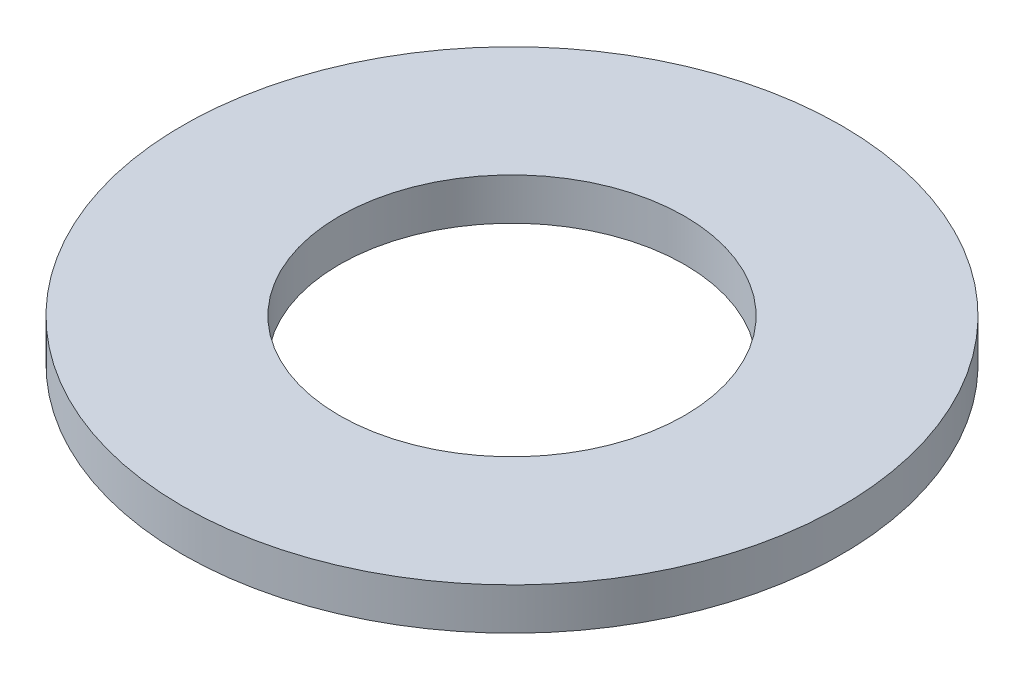
ISO-10303-21;
HEADER;
FILE_DESCRIPTION(('STEP AP214'),'2;1');
FILE_NAME('part.step','',(''),(''),'','','');
FILE_SCHEMA(('AUTOMOTIVE_DESIGN { 1 0 10303 214 1 1 1 1 }'));
ENDSEC;
DATA;
#1=APPLICATION_CONTEXT('core data for automotive mechanical design processes');
#2=APPLICATION_PROTOCOL_DEFINITION('international standard','automotive_design',2000,#1);
#3=PRODUCT_CONTEXT('',#1,'mechanical');
#4=PRODUCT('Part','Part','',(#3));
#5=PRODUCT_RELATED_PRODUCT_CATEGORY('part','',(#4));
#6=PRODUCT_DEFINITION_FORMATION('','',#4);
#7=PRODUCT_DEFINITION_CONTEXT('part definition',#1,'design');
#8=PRODUCT_DEFINITION('design','',#6,#7);
#9=PRODUCT_DEFINITION_SHAPE('','',#8);
#10=(LENGTH_UNIT() NAMED_UNIT(*) SI_UNIT(.MILLI.,.METRE.));
#11=(NAMED_UNIT(*) PLANE_ANGLE_UNIT() SI_UNIT($,.RADIAN.));
#12=(NAMED_UNIT(*) SI_UNIT($,.STERADIAN.) SOLID_ANGLE_UNIT());
#13=UNCERTAINTY_MEASURE_WITH_UNIT(LENGTH_MEASURE(1.E-05),#10,'distance_accuracy_value','');
#14=(GEOMETRIC_REPRESENTATION_CONTEXT(3) GLOBAL_UNCERTAINTY_ASSIGNED_CONTEXT((#13)) GLOBAL_UNIT_ASSIGNED_CONTEXT((#10,
#11,#12)) REPRESENTATION_CONTEXT('',''));
#15=CARTESIAN_POINT('',(0.,0.,0.));
#16=DIRECTION('',(0.,0.,1.));
#17=DIRECTION('',(1.,0.,0.));
#18=AXIS2_PLACEMENT_3D('',#15,#16,#17);
#19=CARTESIAN_POINT('',(0.,1.,0.));
#20=DIRECTION('',(0.,1.,0.));
#21=DIRECTION('',(0.,0.,1.));
#22=AXIS2_PLACEMENT_3D('',#19,#20,#21);
#23=PLANE('',#22);
#24=CARTESIAN_POINT('',(0.,1.,0.));
#25=DIRECTION('',(0.,1.,0.));
#26=DIRECTION('',(0.,0.,1.));
#27=AXIS2_PLACEMENT_3D('',#24,#25,#26);
#28=CIRCLE('',#27,7.875);
#29=CARTESIAN_POINT('',(0.,1.,7.875));
#30=VERTEX_POINT('',#29);
#31=EDGE_CURVE('E10',#30,#30,#28,.T.);
#32=ORIENTED_EDGE('',*,*,#31,.T.);
#33=EDGE_LOOP('',(#32));
#34=FACE_BOUND('',#33,.T.);
#35=CARTESIAN_POINT('',(0.,1.,0.));
#36=DIRECTION('',(0.,1.,0.));
#37=DIRECTION('',(0.,0.,1.));
#38=AXIS2_PLACEMENT_3D('',#35,#36,#37);
#39=CIRCLE('',#38,4.125);
#40=CARTESIAN_POINT('',(0.,1.,4.125));
#41=VERTEX_POINT('',#40);
#42=EDGE_CURVE('E56',#41,#41,#39,.T.);
#43=ORIENTED_EDGE('',*,*,#42,.F.);
#44=EDGE_LOOP('',(#43));
#45=FACE_BOUND('',#44,.T.);
#46=ADVANCED_FACE('F43',(#34,#45),#23,.T.);
#47=CARTESIAN_POINT('',(0.,0.,0.));
#48=DIRECTION('',(0.,1.,0.));
#49=DIRECTION('',(0.,0.,1.));
#50=AXIS2_PLACEMENT_3D('',#47,#48,#49);
#51=PLANE('',#50);
#52=CARTESIAN_POINT('',(0.,0.,0.));
#53=DIRECTION('',(0.,1.,0.));
#54=DIRECTION('',(0.,0.,1.));
#55=AXIS2_PLACEMENT_3D('',#52,#53,#54);
#56=CIRCLE('',#55,7.875);
#57=CARTESIAN_POINT('',(0.,0.,7.875));
#58=VERTEX_POINT('',#57);
#59=EDGE_CURVE('E47',#58,#58,#56,.T.);
#60=ORIENTED_EDGE('',*,*,#59,.F.);
#61=EDGE_LOOP('',(#60));
#62=FACE_BOUND('',#61,.T.);
#63=CARTESIAN_POINT('',(0.,0.,0.));
#64=DIRECTION('',(0.,1.,0.));
#65=DIRECTION('',(0.,0.,1.));
#66=AXIS2_PLACEMENT_3D('',#63,#64,#65);
#67=CIRCLE('',#66,4.125);
#68=CARTESIAN_POINT('',(0.,0.,4.125));
#69=VERTEX_POINT('',#68);
#70=EDGE_CURVE('E58',#69,#69,#67,.T.);
#71=ORIENTED_EDGE('',*,*,#70,.T.);
#72=EDGE_LOOP('',(#71));
#73=FACE_BOUND('',#72,.T.);
#74=ADVANCED_FACE('F70',(#62,#73),#51,.F.);
#75=CARTESIAN_POINT('',(0.,1.,0.));
#76=DIRECTION('',(0.,-1.,0.));
#77=DIRECTION('',(0.,0.,-1.));
#78=AXIS2_PLACEMENT_3D('',#75,#76,#77);
#79=CYLINDRICAL_SURFACE('',#78,7.875);
#80=ORIENTED_EDGE('',*,*,#31,.F.);
#81=EDGE_LOOP('',(#80));
#82=FACE_BOUND('',#81,.T.);
#83=ORIENTED_EDGE('',*,*,#59,.T.);
#84=EDGE_LOOP('',(#83));
#85=FACE_BOUND('',#84,.T.);
#86=ADVANCED_FACE('F45',(#82,#85),#79,.T.);
#87=CARTESIAN_POINT('',(0.,1.,0.));
#88=DIRECTION('',(0.,-1.,0.));
#89=DIRECTION('',(0.,0.,-1.));
#90=AXIS2_PLACEMENT_3D('',#87,#88,#89);
#91=CYLINDRICAL_SURFACE('',#90,4.125);
#92=ORIENTED_EDGE('',*,*,#42,.T.);
#93=EDGE_LOOP('',(#92));
#94=FACE_BOUND('',#93,.T.);
#95=ORIENTED_EDGE('',*,*,#70,.F.);
#96=EDGE_LOOP('',(#95));
#97=FACE_BOUND('',#96,.T.);
#98=ADVANCED_FACE('F66',(#94,#97),#91,.F.);
#99=CLOSED_SHELL('',(#46,#74,#86,#98));
#100=MANIFOLD_SOLID_BREP('B2',#99);
#101=ADVANCED_BREP_SHAPE_REPRESENTATION('',(#18,#100),#14);
#102=SHAPE_DEFINITION_REPRESENTATION(#9,#101);
ENDSEC;
END-ISO-10303-21;
